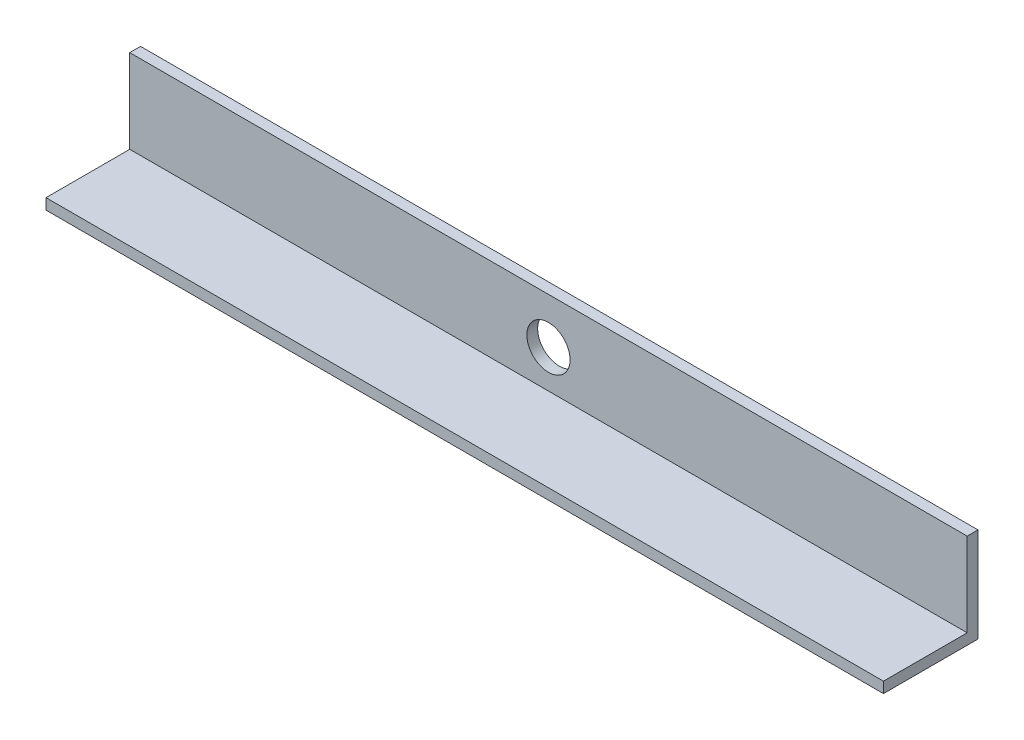
ISO-10303-21;
HEADER;
FILE_DESCRIPTION(('STEP AP214'),'2;1');
FILE_NAME('part.step','',(''),(''),'','','');
FILE_SCHEMA(('AUTOMOTIVE_DESIGN { 1 0 10303 214 1 1 1 1 }'));
ENDSEC;
DATA;
#1=APPLICATION_CONTEXT('core data for automotive mechanical design processes');
#2=APPLICATION_PROTOCOL_DEFINITION('international standard','automotive_design',2000,#1);
#3=PRODUCT_CONTEXT('',#1,'mechanical');
#4=PRODUCT('Part','Part','',(#3));
#5=PRODUCT_RELATED_PRODUCT_CATEGORY('part','',(#4));
#6=PRODUCT_DEFINITION_FORMATION('','',#4);
#7=PRODUCT_DEFINITION_CONTEXT('part definition',#1,'design');
#8=PRODUCT_DEFINITION('design','',#6,#7);
#9=PRODUCT_DEFINITION_SHAPE('','',#8);
#10=(LENGTH_UNIT() NAMED_UNIT(*) SI_UNIT(.MILLI.,.METRE.));
#11=(NAMED_UNIT(*) PLANE_ANGLE_UNIT() SI_UNIT($,.RADIAN.));
#12=(NAMED_UNIT(*) SI_UNIT($,.STERADIAN.) SOLID_ANGLE_UNIT());
#13=UNCERTAINTY_MEASURE_WITH_UNIT(LENGTH_MEASURE(1.E-05),#10,'distance_accuracy_value','');
#14=(GEOMETRIC_REPRESENTATION_CONTEXT(3) GLOBAL_UNCERTAINTY_ASSIGNED_CONTEXT((#13)) GLOBAL_UNIT_ASSIGNED_CONTEXT((#10,
#11,#12)) REPRESENTATION_CONTEXT('',''));
#15=CARTESIAN_POINT('',(0.,0.,0.));
#16=DIRECTION('',(0.,0.,1.));
#17=DIRECTION('',(1.,0.,0.));
#18=AXIS2_PLACEMENT_3D('',#15,#16,#17);
#19=CARTESIAN_POINT('',(310.,4.,0.));
#20=DIRECTION('',(0.,-1.,0.));
#21=DIRECTION('',(0.,0.,-1.));
#22=AXIS2_PLACEMENT_3D('',#19,#20,#21);
#23=PLANE('',#22);
#24=DIRECTION('',(0.,0.,1.));
#25=VECTOR('',#24,1.);
#26=CARTESIAN_POINT('',(0.,4.,0.));
#27=LINE('',#26,#25);
#28=CARTESIAN_POINT('',(0.,4.,4.));
#29=VERTEX_POINT('',#28);
#30=CARTESIAN_POINT('',(0.,4.,35.));
#31=VERTEX_POINT('',#30);
#32=EDGE_CURVE('E116',#29,#31,#27,.T.);
#33=ORIENTED_EDGE('',*,*,#32,.T.);
#34=DIRECTION('',(-1.,0.,0.));
#35=VECTOR('',#34,1.);
#36=CARTESIAN_POINT('',(310.,4.,35.));
#37=LINE('',#36,#35);
#38=CARTESIAN_POINT('',(310.,4.,35.));
#39=VERTEX_POINT('',#38);
#40=EDGE_CURVE('E11',#39,#31,#37,.T.);
#41=ORIENTED_EDGE('',*,*,#40,.F.);
#42=DIRECTION('',(0.,0.,1.));
#43=VECTOR('',#42,1.);
#44=CARTESIAN_POINT('',(310.,4.,0.));
#45=LINE('',#44,#43);
#46=CARTESIAN_POINT('',(310.,4.,4.));
#47=VERTEX_POINT('',#46);
#48=EDGE_CURVE('E81',#47,#39,#45,.T.);
#49=ORIENTED_EDGE('',*,*,#48,.F.);
#50=DIRECTION('',(-1.,0.,0.));
#51=VECTOR('',#50,1.);
#52=CARTESIAN_POINT('',(310.,4.,4.));
#53=LINE('',#52,#51);
#54=EDGE_CURVE('E112',#47,#29,#53,.T.);
#55=ORIENTED_EDGE('',*,*,#54,.T.);
#56=EDGE_LOOP('',(#33,#41,#49,#55));
#57=FACE_BOUND('',#56,.T.);
#58=ADVANCED_FACE('F34',(#57),#23,.F.);
#59=CARTESIAN_POINT('',(310.,0.,35.));
#60=DIRECTION('',(0.,0.,1.));
#61=DIRECTION('',(1.,0.,0.));
#62=AXIS2_PLACEMENT_3D('',#59,#60,#61);
#63=PLANE('',#62);
#64=DIRECTION('',(0.,1.,0.));
#65=VECTOR('',#64,1.);
#66=CARTESIAN_POINT('',(0.,0.,35.));
#67=LINE('',#66,#65);
#68=CARTESIAN_POINT('',(0.,0.,35.));
#69=VERTEX_POINT('',#68);
#70=EDGE_CURVE('E119',#69,#31,#67,.T.);
#71=ORIENTED_EDGE('',*,*,#70,.F.);
#72=DIRECTION('',(-1.,0.,0.));
#73=VECTOR('',#72,1.);
#74=CARTESIAN_POINT('',(310.,0.,35.));
#75=LINE('',#74,#73);
#76=CARTESIAN_POINT('',(310.,0.,35.));
#77=VERTEX_POINT('',#76);
#78=EDGE_CURVE('E43',#77,#69,#75,.T.);
#79=ORIENTED_EDGE('',*,*,#78,.F.);
#80=DIRECTION('',(0.,1.,0.));
#81=VECTOR('',#80,1.);
#82=CARTESIAN_POINT('',(310.,0.,35.));
#83=LINE('',#82,#81);
#84=EDGE_CURVE('E175',#77,#39,#83,.T.);
#85=ORIENTED_EDGE('',*,*,#84,.T.);
#86=ORIENTED_EDGE('',*,*,#40,.T.);
#87=EDGE_LOOP('',(#71,#79,#85,#86));
#88=FACE_BOUND('',#87,.T.);
#89=ADVANCED_FACE('F138',(#88),#63,.T.);
#90=CARTESIAN_POINT('',(310.,0.,0.));
#91=DIRECTION('',(0.,-1.,0.));
#92=DIRECTION('',(0.,0.,-1.));
#93=AXIS2_PLACEMENT_3D('',#90,#91,#92);
#94=PLANE('',#93);
#95=DIRECTION('',(0.,0.,1.));
#96=VECTOR('',#95,1.);
#97=CARTESIAN_POINT('',(0.,0.,0.));
#98=LINE('',#97,#96);
#99=CARTESIAN_POINT('',(0.,0.,0.));
#100=VERTEX_POINT('',#99);
#101=EDGE_CURVE('E122',#100,#69,#98,.T.);
#102=ORIENTED_EDGE('',*,*,#101,.F.);
#103=DIRECTION('',(-1.,0.,0.));
#104=VECTOR('',#103,1.);
#105=CARTESIAN_POINT('',(310.,0.,0.));
#106=LINE('',#105,#104);
#107=CARTESIAN_POINT('',(310.,0.,0.));
#108=VERTEX_POINT('',#107);
#109=EDGE_CURVE('E102',#108,#100,#106,.T.);
#110=ORIENTED_EDGE('',*,*,#109,.F.);
#111=DIRECTION('',(0.,0.,1.));
#112=VECTOR('',#111,1.);
#113=CARTESIAN_POINT('',(310.,0.,0.));
#114=LINE('',#113,#112);
#115=EDGE_CURVE('E108',#108,#77,#114,.T.);
#116=ORIENTED_EDGE('',*,*,#115,.T.);
#117=ORIENTED_EDGE('',*,*,#78,.T.);
#118=EDGE_LOOP('',(#102,#110,#116,#117));
#119=FACE_BOUND('',#118,.T.);
#120=ADVANCED_FACE('F135',(#119),#94,.T.);
#121=CARTESIAN_POINT('',(310.,35.,0.));
#122=DIRECTION('',(0.,0.,-1.));
#123=DIRECTION('',(0.,1.,0.));
#124=AXIS2_PLACEMENT_3D('',#121,#122,#123);
#125=PLANE('',#124);
#126=CARTESIAN_POINT('',(155.,18.,0.));
#127=DIRECTION('',(0.,0.,-1.));
#128=DIRECTION('',(0.,1.,0.));
#129=AXIS2_PLACEMENT_3D('',#126,#127,#128);
#130=CIRCLE('',#129,8.00000000000001);
#131=CARTESIAN_POINT('',(155.,26.,0.));
#132=VERTEX_POINT('',#131);
#133=EDGE_CURVE('E170',#132,#132,#130,.T.);
#134=ORIENTED_EDGE('',*,*,#133,.F.);
#135=EDGE_LOOP('',(#134));
#136=FACE_BOUND('',#135,.T.);
#137=DIRECTION('',(0.,-1.,0.));
#138=VECTOR('',#137,1.);
#139=CARTESIAN_POINT('',(0.,35.,0.));
#140=LINE('',#139,#138);
#141=CARTESIAN_POINT('',(0.,35.,0.));
#142=VERTEX_POINT('',#141);
#143=EDGE_CURVE('E97',#142,#100,#140,.T.);
#144=ORIENTED_EDGE('',*,*,#143,.F.);
#145=DIRECTION('',(-1.,0.,0.));
#146=VECTOR('',#145,1.);
#147=CARTESIAN_POINT('',(310.,35.,0.));
#148=LINE('',#147,#146);
#149=CARTESIAN_POINT('',(310.,35.,0.));
#150=VERTEX_POINT('',#149);
#151=EDGE_CURVE('E92',#150,#142,#148,.T.);
#152=ORIENTED_EDGE('',*,*,#151,.F.);
#153=DIRECTION('',(0.,-1.,0.));
#154=VECTOR('',#153,1.);
#155=CARTESIAN_POINT('',(310.,35.,0.));
#156=LINE('',#155,#154);
#157=EDGE_CURVE('E95',#150,#108,#156,.T.);
#158=ORIENTED_EDGE('',*,*,#157,.T.);
#159=ORIENTED_EDGE('',*,*,#109,.T.);
#160=EDGE_LOOP('',(#144,#152,#158,#159));
#161=FACE_BOUND('',#160,.T.);
#162=ADVANCED_FACE('F94',(#136,#161),#125,.T.);
#163=CARTESIAN_POINT('',(310.,35.,4.));
#164=DIRECTION('',(0.,1.,0.));
#165=DIRECTION('',(0.,0.,1.));
#166=AXIS2_PLACEMENT_3D('',#163,#164,#165);
#167=PLANE('',#166);
#168=DIRECTION('',(0.,0.,-1.));
#169=VECTOR('',#168,1.);
#170=CARTESIAN_POINT('',(0.,35.,4.));
#171=LINE('',#170,#169);
#172=CARTESIAN_POINT('',(0.,35.,4.));
#173=VERTEX_POINT('',#172);
#174=EDGE_CURVE('E126',#173,#142,#171,.T.);
#175=ORIENTED_EDGE('',*,*,#174,.F.);
#176=DIRECTION('',(-1.,0.,0.));
#177=VECTOR('',#176,1.);
#178=CARTESIAN_POINT('',(310.,35.,4.));
#179=LINE('',#178,#177);
#180=CARTESIAN_POINT('',(310.,35.,4.));
#181=VERTEX_POINT('',#180);
#182=EDGE_CURVE('E72',#181,#173,#179,.T.);
#183=ORIENTED_EDGE('',*,*,#182,.F.);
#184=DIRECTION('',(0.,0.,-1.));
#185=VECTOR('',#184,1.);
#186=CARTESIAN_POINT('',(310.,35.,4.));
#187=LINE('',#186,#185);
#188=EDGE_CURVE('E106',#181,#150,#187,.T.);
#189=ORIENTED_EDGE('',*,*,#188,.T.);
#190=ORIENTED_EDGE('',*,*,#151,.T.);
#191=EDGE_LOOP('',(#175,#183,#189,#190));
#192=FACE_BOUND('',#191,.T.);
#193=ADVANCED_FACE('F110',(#192),#167,.T.);
#194=CARTESIAN_POINT('',(310.,35.,4.));
#195=DIRECTION('',(0.,0.,-1.));
#196=DIRECTION('',(0.,1.,0.));
#197=AXIS2_PLACEMENT_3D('',#194,#195,#196);
#198=PLANE('',#197);
#199=CARTESIAN_POINT('',(155.,18.,4.));
#200=DIRECTION('',(0.,0.,-1.));
#201=DIRECTION('',(0.,1.,0.));
#202=AXIS2_PLACEMENT_3D('',#199,#200,#201);
#203=CIRCLE('',#202,8.00000000000001);
#204=CARTESIAN_POINT('',(155.,26.,4.));
#205=VERTEX_POINT('',#204);
#206=EDGE_CURVE('E37',#205,#205,#203,.T.);
#207=ORIENTED_EDGE('',*,*,#206,.T.);
#208=EDGE_LOOP('',(#207));
#209=FACE_BOUND('',#208,.T.);
#210=DIRECTION('',(0.,-1.,0.));
#211=VECTOR('',#210,1.);
#212=CARTESIAN_POINT('',(0.,35.,4.));
#213=LINE('',#212,#211);
#214=EDGE_CURVE('E75',#173,#29,#213,.T.);
#215=ORIENTED_EDGE('',*,*,#214,.T.);
#216=ORIENTED_EDGE('',*,*,#54,.F.);
#217=DIRECTION('',(0.,-1.,0.));
#218=VECTOR('',#217,1.);
#219=CARTESIAN_POINT('',(310.,35.,4.));
#220=LINE('',#219,#218);
#221=EDGE_CURVE('E51',#181,#47,#220,.T.);
#222=ORIENTED_EDGE('',*,*,#221,.F.);
#223=ORIENTED_EDGE('',*,*,#182,.T.);
#224=EDGE_LOOP('',(#215,#216,#222,#223));
#225=FACE_BOUND('',#224,.T.);
#226=ADVANCED_FACE('F143',(#209,#225),#198,.F.);
#227=CARTESIAN_POINT('',(310.,0.,0.));
#228=DIRECTION('',(-1.,0.,0.));
#229=DIRECTION('',(0.,0.,1.));
#230=AXIS2_PLACEMENT_3D('',#227,#228,#229);
#231=PLANE('',#230);
#232=ORIENTED_EDGE('',*,*,#48,.T.);
#233=ORIENTED_EDGE('',*,*,#84,.F.);
#234=ORIENTED_EDGE('',*,*,#115,.F.);
#235=ORIENTED_EDGE('',*,*,#157,.F.);
#236=ORIENTED_EDGE('',*,*,#188,.F.);
#237=ORIENTED_EDGE('',*,*,#221,.T.);
#238=EDGE_LOOP('',(#232,#233,#234,#235,#236,#237));
#239=FACE_BOUND('',#238,.T.);
#240=ADVANCED_FACE('F105',(#239),#231,.F.);
#241=CARTESIAN_POINT('',(0.,0.,0.));
#242=DIRECTION('',(-1.,0.,0.));
#243=DIRECTION('',(0.,0.,1.));
#244=AXIS2_PLACEMENT_3D('',#241,#242,#243);
#245=PLANE('',#244);
#246=ORIENTED_EDGE('',*,*,#32,.F.);
#247=ORIENTED_EDGE('',*,*,#214,.F.);
#248=ORIENTED_EDGE('',*,*,#174,.T.);
#249=ORIENTED_EDGE('',*,*,#143,.T.);
#250=ORIENTED_EDGE('',*,*,#101,.T.);
#251=ORIENTED_EDGE('',*,*,#70,.T.);
#252=EDGE_LOOP('',(#246,#247,#248,#249,#250,#251));
#253=FACE_BOUND('',#252,.T.);
#254=ADVANCED_FACE('F141',(#253),#245,.T.);
#255=CARTESIAN_POINT('',(155.,18.,10.));
#256=DIRECTION('',(0.,0.,-1.));
#257=DIRECTION('',(0.,1.,0.));
#258=AXIS2_PLACEMENT_3D('',#255,#256,#257);
#259=CYLINDRICAL_SURFACE('',#258,8.00000000000001);
#260=ORIENTED_EDGE('',*,*,#133,.T.);
#261=EDGE_LOOP('',(#260));
#262=FACE_BOUND('',#261,.T.);
#263=ORIENTED_EDGE('',*,*,#206,.F.);
#264=EDGE_LOOP('',(#263));
#265=FACE_BOUND('',#264,.T.);
#266=ADVANCED_FACE('F178',(#262,#265),#259,.F.);
#267=CLOSED_SHELL('',(#58,#89,#120,#162,#193,#226,#240,#254,#266));
#268=MANIFOLD_SOLID_BREP('B2',#267);
#269=ADVANCED_BREP_SHAPE_REPRESENTATION('',(#18,#268),#14);
#270=SHAPE_DEFINITION_REPRESENTATION(#9,#269);
ENDSEC;
END-ISO-10303-21;
